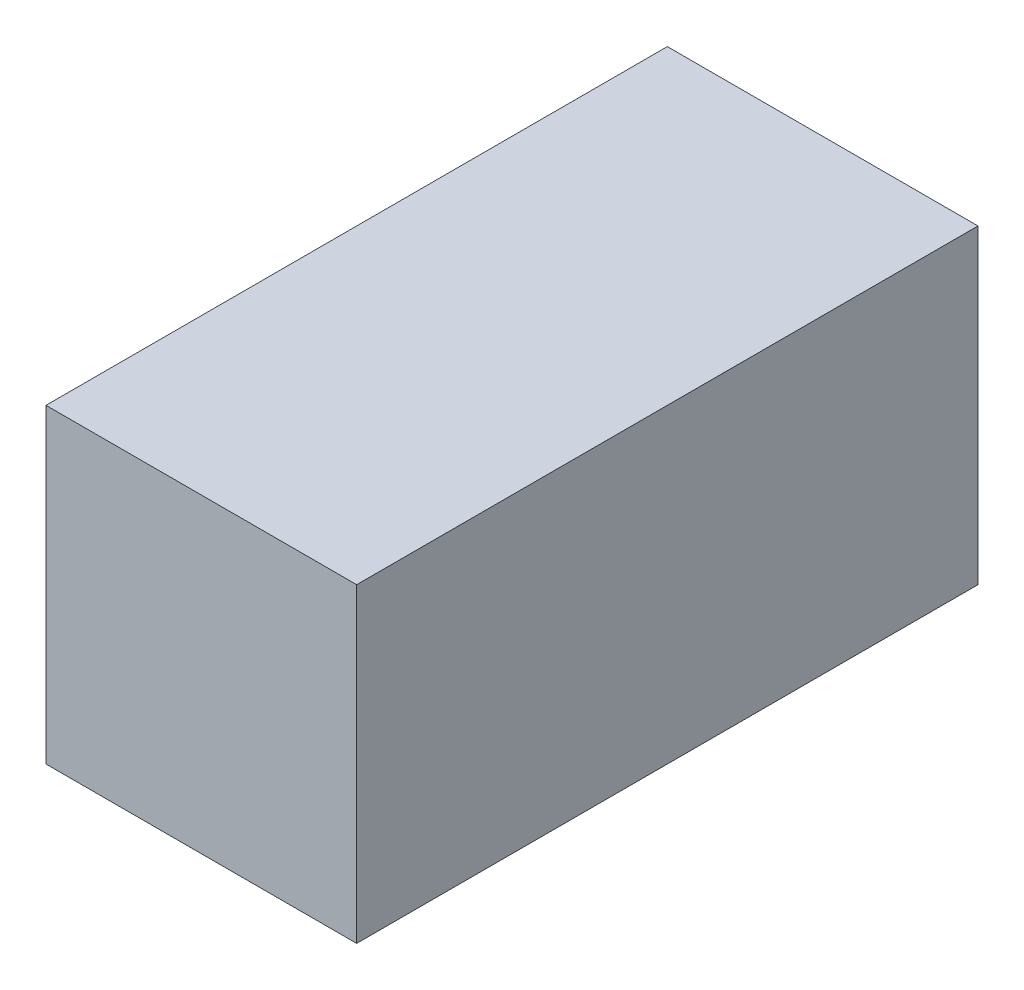
ISO-10303-21;
HEADER;
FILE_DESCRIPTION(('STEP AP214'),'2;1');
FILE_NAME('part.step','',(''),(''),'','','');
FILE_SCHEMA(('AUTOMOTIVE_DESIGN { 1 0 10303 214 1 1 1 1 }'));
ENDSEC;
DATA;
#1=APPLICATION_CONTEXT('core data for automotive mechanical design processes');
#2=APPLICATION_PROTOCOL_DEFINITION('international standard','automotive_design',2000,#1);
#3=PRODUCT_CONTEXT('',#1,'mechanical');
#4=PRODUCT('Part','Part','',(#3));
#5=PRODUCT_RELATED_PRODUCT_CATEGORY('part','',(#4));
#6=PRODUCT_DEFINITION_FORMATION('','',#4);
#7=PRODUCT_DEFINITION_CONTEXT('part definition',#1,'design');
#8=PRODUCT_DEFINITION('design','',#6,#7);
#9=PRODUCT_DEFINITION_SHAPE('','',#8);
#10=(LENGTH_UNIT() NAMED_UNIT(*) SI_UNIT(.MILLI.,.METRE.));
#11=(NAMED_UNIT(*) PLANE_ANGLE_UNIT() SI_UNIT($,.RADIAN.));
#12=(NAMED_UNIT(*) SI_UNIT($,.STERADIAN.) SOLID_ANGLE_UNIT());
#13=UNCERTAINTY_MEASURE_WITH_UNIT(LENGTH_MEASURE(1.E-05),#10,'distance_accuracy_value','');
#14=(GEOMETRIC_REPRESENTATION_CONTEXT(3) GLOBAL_UNCERTAINTY_ASSIGNED_CONTEXT((#13)) GLOBAL_UNIT_ASSIGNED_CONTEXT((#10,
#11,#12)) REPRESENTATION_CONTEXT('',''));
#15=CARTESIAN_POINT('',(0.,0.,0.));
#16=DIRECTION('',(0.,0.,1.));
#17=DIRECTION('',(1.,0.,0.));
#18=AXIS2_PLACEMENT_3D('',#15,#16,#17);
#19=CARTESIAN_POINT('',(2.5,-2.5,10.));
#20=DIRECTION('',(-1.,0.,0.));
#21=DIRECTION('',(0.,0.,1.));
#22=AXIS2_PLACEMENT_3D('',#19,#20,#21);
#23=PLANE('',#22);
#24=DIRECTION('',(0.,1.,0.));
#25=VECTOR('',#24,1.);
#26=CARTESIAN_POINT('',(2.5,-2.5,0.));
#27=LINE('',#26,#25);
#28=CARTESIAN_POINT('',(2.5,-2.5,0.));
#29=VERTEX_POINT('',#28);
#30=CARTESIAN_POINT('',(2.5,2.5,0.));
#31=VERTEX_POINT('',#30);
#32=EDGE_CURVE('E96',#29,#31,#27,.T.);
#33=ORIENTED_EDGE('',*,*,#32,.T.);
#34=DIRECTION('',(0.,0.,-1.));
#35=VECTOR('',#34,1.);
#36=CARTESIAN_POINT('',(2.5,2.5,10.));
#37=LINE('',#36,#35);
#38=CARTESIAN_POINT('',(2.5,2.5,10.));
#39=VERTEX_POINT('',#38);
#40=EDGE_CURVE('E11',#39,#31,#37,.T.);
#41=ORIENTED_EDGE('',*,*,#40,.F.);
#42=DIRECTION('',(0.,1.,0.));
#43=VECTOR('',#42,1.);
#44=CARTESIAN_POINT('',(2.5,-2.5,10.));
#45=LINE('',#44,#43);
#46=CARTESIAN_POINT('',(2.5,-2.5,10.));
#47=VERTEX_POINT('',#46);
#48=EDGE_CURVE('E84',#47,#39,#45,.T.);
#49=ORIENTED_EDGE('',*,*,#48,.F.);
#50=DIRECTION('',(0.,0.,-1.));
#51=VECTOR('',#50,1.);
#52=CARTESIAN_POINT('',(2.5,-2.5,10.));
#53=LINE('',#52,#51);
#54=EDGE_CURVE('E92',#47,#29,#53,.T.);
#55=ORIENTED_EDGE('',*,*,#54,.T.);
#56=EDGE_LOOP('',(#33,#41,#49,#55));
#57=FACE_BOUND('',#56,.T.);
#58=ADVANCED_FACE('F33',(#57),#23,.F.);
#59=CARTESIAN_POINT('',(-2.5,2.5,10.));
#60=DIRECTION('',(0.,-1.,0.));
#61=DIRECTION('',(0.,0.,-1.));
#62=AXIS2_PLACEMENT_3D('',#59,#60,#61);
#63=PLANE('',#62);
#64=DIRECTION('',(-1.,0.,0.));
#65=VECTOR('',#64,1.);
#66=CARTESIAN_POINT('',(-2.5,2.5,0.));
#67=LINE('',#66,#65);
#68=CARTESIAN_POINT('',(-2.5,2.5,0.));
#69=VERTEX_POINT('',#68);
#70=EDGE_CURVE('E88',#31,#69,#67,.T.);
#71=ORIENTED_EDGE('',*,*,#70,.T.);
#72=DIRECTION('',(0.,0.,-1.));
#73=VECTOR('',#72,1.);
#74=CARTESIAN_POINT('',(-2.5,2.5,10.));
#75=LINE('',#74,#73);
#76=CARTESIAN_POINT('',(-2.5,2.5,10.));
#77=VERTEX_POINT('',#76);
#78=EDGE_CURVE('E41',#77,#69,#75,.T.);
#79=ORIENTED_EDGE('',*,*,#78,.F.);
#80=DIRECTION('',(-1.,0.,0.));
#81=VECTOR('',#80,1.);
#82=CARTESIAN_POINT('',(-2.5,2.5,10.));
#83=LINE('',#82,#81);
#84=EDGE_CURVE('E79',#39,#77,#83,.T.);
#85=ORIENTED_EDGE('',*,*,#84,.F.);
#86=ORIENTED_EDGE('',*,*,#40,.T.);
#87=EDGE_LOOP('',(#71,#79,#85,#86));
#88=FACE_BOUND('',#87,.T.);
#89=ADVANCED_FACE('F87',(#88),#63,.F.);
#90=CARTESIAN_POINT('',(-2.5,-2.5,10.));
#91=DIRECTION('',(1.,0.,0.));
#92=DIRECTION('',(0.,0.,-1.));
#93=AXIS2_PLACEMENT_3D('',#90,#91,#92);
#94=PLANE('',#93);
#95=DIRECTION('',(0.,-1.,0.));
#96=VECTOR('',#95,1.);
#97=CARTESIAN_POINT('',(-2.5,-2.5,0.));
#98=LINE('',#97,#96);
#99=CARTESIAN_POINT('',(-2.5,-2.5,0.));
#100=VERTEX_POINT('',#99);
#101=EDGE_CURVE('E66',#69,#100,#98,.T.);
#102=ORIENTED_EDGE('',*,*,#101,.T.);
#103=DIRECTION('',(0.,0.,-1.));
#104=VECTOR('',#103,1.);
#105=CARTESIAN_POINT('',(-2.5,-2.5,10.));
#106=LINE('',#105,#104);
#107=CARTESIAN_POINT('',(-2.5,-2.5,10.));
#108=VERTEX_POINT('',#107);
#109=EDGE_CURVE('E89',#108,#100,#106,.T.);
#110=ORIENTED_EDGE('',*,*,#109,.F.);
#111=DIRECTION('',(0.,-1.,0.));
#112=VECTOR('',#111,1.);
#113=CARTESIAN_POINT('',(-2.5,-2.5,10.));
#114=LINE('',#113,#112);
#115=EDGE_CURVE('E82',#77,#108,#114,.T.);
#116=ORIENTED_EDGE('',*,*,#115,.F.);
#117=ORIENTED_EDGE('',*,*,#78,.T.);
#118=EDGE_LOOP('',(#102,#110,#116,#117));
#119=FACE_BOUND('',#118,.T.);
#120=ADVANCED_FACE('F90',(#119),#94,.F.);
#121=CARTESIAN_POINT('',(-2.5,-2.5,10.));
#122=DIRECTION('',(0.,1.,0.));
#123=DIRECTION('',(0.,0.,1.));
#124=AXIS2_PLACEMENT_3D('',#121,#122,#123);
#125=PLANE('',#124);
#126=DIRECTION('',(1.,0.,0.));
#127=VECTOR('',#126,1.);
#128=CARTESIAN_POINT('',(-2.5,-2.5,0.));
#129=LINE('',#128,#127);
#130=EDGE_CURVE('E72',#100,#29,#129,.T.);
#131=ORIENTED_EDGE('',*,*,#130,.T.);
#132=ORIENTED_EDGE('',*,*,#54,.F.);
#133=DIRECTION('',(1.,0.,0.));
#134=VECTOR('',#133,1.);
#135=CARTESIAN_POINT('',(-2.5,-2.5,10.));
#136=LINE('',#135,#134);
#137=EDGE_CURVE('E49',#108,#47,#136,.T.);
#138=ORIENTED_EDGE('',*,*,#137,.F.);
#139=ORIENTED_EDGE('',*,*,#109,.T.);
#140=EDGE_LOOP('',(#131,#132,#138,#139));
#141=FACE_BOUND('',#140,.T.);
#142=ADVANCED_FACE('F103',(#141),#125,.F.);
#143=CARTESIAN_POINT('',(0.,0.,10.));
#144=DIRECTION('',(0.,0.,-1.));
#145=DIRECTION('',(-1.,0.,0.));
#146=AXIS2_PLACEMENT_3D('',#143,#144,#145);
#147=PLANE('',#146);
#148=ORIENTED_EDGE('',*,*,#48,.T.);
#149=ORIENTED_EDGE('',*,*,#84,.T.);
#150=ORIENTED_EDGE('',*,*,#115,.T.);
#151=ORIENTED_EDGE('',*,*,#137,.T.);
#152=EDGE_LOOP('',(#148,#149,#150,#151));
#153=FACE_BOUND('',#152,.T.);
#154=ADVANCED_FACE('F80',(#153),#147,.F.);
#155=CARTESIAN_POINT('',(0.,0.,0.));
#156=DIRECTION('',(0.,0.,-1.));
#157=DIRECTION('',(-1.,0.,0.));
#158=AXIS2_PLACEMENT_3D('',#155,#156,#157);
#159=PLANE('',#158);
#160=ORIENTED_EDGE('',*,*,#32,.F.);
#161=ORIENTED_EDGE('',*,*,#130,.F.);
#162=ORIENTED_EDGE('',*,*,#101,.F.);
#163=ORIENTED_EDGE('',*,*,#70,.F.);
#164=EDGE_LOOP('',(#160,#161,#162,#163));
#165=FACE_BOUND('',#164,.T.);
#166=ADVANCED_FACE('F106',(#165),#159,.T.);
#167=CLOSED_SHELL('',(#58,#89,#120,#142,#154,#166));
#168=MANIFOLD_SOLID_BREP('B2',#167);
#169=ADVANCED_BREP_SHAPE_REPRESENTATION('',(#18,#168),#14);
#170=SHAPE_DEFINITION_REPRESENTATION(#9,#169);
ENDSEC;
END-ISO-10303-21;
